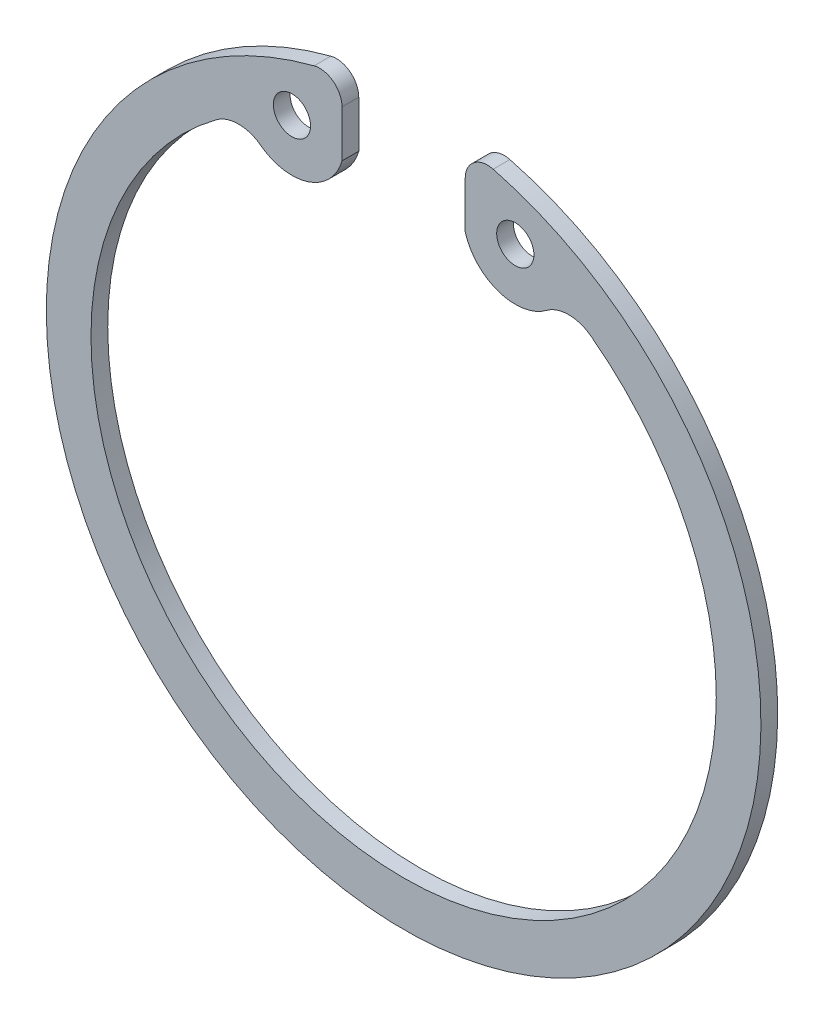
ISO-10303-21;
HEADER;
FILE_DESCRIPTION(('STEP AP214'),'2;1');
FILE_NAME('part.step','',(''),(''),'','','');
FILE_SCHEMA(('AUTOMOTIVE_DESIGN { 1 0 10303 214 1 1 1 1 }'));
ENDSEC;
DATA;
#1=APPLICATION_CONTEXT('core data for automotive mechanical design processes');
#2=APPLICATION_PROTOCOL_DEFINITION('international standard','automotive_design',2000,#1);
#3=PRODUCT_CONTEXT('',#1,'mechanical');
#4=PRODUCT('Part','Part','',(#3));
#5=PRODUCT_RELATED_PRODUCT_CATEGORY('part','',(#4));
#6=PRODUCT_DEFINITION_FORMATION('','',#4);
#7=PRODUCT_DEFINITION_CONTEXT('part definition',#1,'design');
#8=PRODUCT_DEFINITION('design','',#6,#7);
#9=PRODUCT_DEFINITION_SHAPE('','',#8);
#10=(LENGTH_UNIT() NAMED_UNIT(*) SI_UNIT(.MILLI.,.METRE.));
#11=(NAMED_UNIT(*) PLANE_ANGLE_UNIT() SI_UNIT($,.RADIAN.));
#12=(NAMED_UNIT(*) SI_UNIT($,.STERADIAN.) SOLID_ANGLE_UNIT());
#13=UNCERTAINTY_MEASURE_WITH_UNIT(LENGTH_MEASURE(1.E-05),#10,'distance_accuracy_value','');
#14=(GEOMETRIC_REPRESENTATION_CONTEXT(3) GLOBAL_UNCERTAINTY_ASSIGNED_CONTEXT((#13)) GLOBAL_UNIT_ASSIGNED_CONTEXT((#10,
#11,#12)) REPRESENTATION_CONTEXT('',''));
#15=CARTESIAN_POINT('',(0.,0.,0.));
#16=DIRECTION('',(0.,0.,1.));
#17=DIRECTION('',(1.,0.,0.));
#18=AXIS2_PLACEMENT_3D('',#15,#16,#17);
#19=CARTESIAN_POINT('',(-2.86411934203322,11.0653386931712,0.));
#20=DIRECTION('',(0.,0.,1.));
#21=DIRECTION('',(1.,0.,0.));
#22=AXIS2_PLACEMENT_3D('',#19,#20,#21);
#23=PLANE('',#22);
#24=DIRECTION('',(0.,1.,0.));
#25=VECTOR('',#24,1.);
#26=CARTESIAN_POINT('',(-2.10211934203322,11.0653386931712,0.));
#27=LINE('',#26,#25);
#28=CARTESIAN_POINT('',(-2.10211934203322,9.47004672873562,0.));
#29=VERTEX_POINT('',#28);
#30=CARTESIAN_POINT('',(-2.10211934203322,11.0653386931712,0.));
#31=VERTEX_POINT('',#30);
#32=EDGE_CURVE('E91',#29,#31,#27,.T.);
#33=ORIENTED_EDGE('',*,*,#32,.F.);
#34=CARTESIAN_POINT('',(-3.81,9.96444298493399,0.));
#35=DIRECTION('',(0.,0.,1.));
#36=DIRECTION('',(1.,0.,0.));
#37=AXIS2_PLACEMENT_3D('',#34,#35,#36);
#38=CIRCLE('',#37,1.778);
#39=CARTESIAN_POINT('',(-4.87382343732679,8.53981542160587,0.));
#40=VERTEX_POINT('',#39);
#41=EDGE_CURVE('E122',#40,#29,#38,.T.);
#42=ORIENTED_EDGE('',*,*,#41,.F.);
#43=CARTESIAN_POINT('',(-5.63369732113164,7.52222430494292,0.));
#44=DIRECTION('',(0.,0.,1.));
#45=DIRECTION('',(1.,0.,0.));
#46=AXIS2_PLACEMENT_3D('',#43,#44,#45);
#47=CIRCLE('',#46,1.27);
#48=CARTESIAN_POINT('',(-6.39500776993322,8.53874110290818,0.));
#49=VERTEX_POINT('',#48);
#50=EDGE_CURVE('E125',#40,#49,#47,.T.);
#51=ORIENTED_EDGE('',*,*,#50,.T.);
#52=CARTESIAN_POINT('',(0.,0.,0.));
#53=DIRECTION('',(0.,0.,1.));
#54=DIRECTION('',(1.,0.,0.));
#55=AXIS2_PLACEMENT_3D('',#52,#53,#54);
#56=CIRCLE('',#55,10.668);
#57=CARTESIAN_POINT('',(6.39500780535568,8.53874107637886,0.));
#58=VERTEX_POINT('',#57);
#59=EDGE_CURVE('E126',#49,#58,#56,.T.);
#60=ORIENTED_EDGE('',*,*,#59,.T.);
#61=CARTESIAN_POINT('',(5.63369732113164,7.52222430494292,0.));
#62=DIRECTION('',(0.,0.,1.));
#63=DIRECTION('',(1.,0.,0.));
#64=AXIS2_PLACEMENT_3D('',#61,#62,#63);
#65=CIRCLE('',#64,1.26999999999999);
#66=CARTESIAN_POINT('',(4.8738234373268,8.53981542160585,0.));
#67=VERTEX_POINT('',#66);
#68=EDGE_CURVE('E129',#58,#67,#65,.T.);
#69=ORIENTED_EDGE('',*,*,#68,.T.);
#70=CARTESIAN_POINT('',(3.81,9.96444298493396,0.));
#71=DIRECTION('',(0.,0.,1.));
#72=DIRECTION('',(1.,0.,0.));
#73=AXIS2_PLACEMENT_3D('',#70,#71,#72);
#74=CIRCLE('',#73,1.778);
#75=CARTESIAN_POINT('',(2.10211934203322,9.47004672873561,0.));
#76=VERTEX_POINT('',#75);
#77=EDGE_CURVE('E135',#76,#67,#74,.T.);
#78=ORIENTED_EDGE('',*,*,#77,.F.);
#79=DIRECTION('',(0.,1.,0.));
#80=VECTOR('',#79,1.);
#81=CARTESIAN_POINT('',(2.10211934203322,11.0653386931712,0.));
#82=LINE('',#81,#80);
#83=CARTESIAN_POINT('',(2.10211934203322,11.0653386931712,0.));
#84=VERTEX_POINT('',#83);
#85=EDGE_CURVE('E138',#76,#84,#82,.T.);
#86=ORIENTED_EDGE('',*,*,#85,.T.);
#87=CARTESIAN_POINT('',(2.86411934203322,11.0653386931712,0.));
#88=DIRECTION('',(0.,0.,1.));
#89=DIRECTION('',(1.,0.,0.));
#90=AXIS2_PLACEMENT_3D('',#87,#88,#89);
#91=CIRCLE('',#90,0.762);
#92=CARTESIAN_POINT('',(3.0550606315021,11.8030279393826,0.));
#93=VERTEX_POINT('',#92);
#94=EDGE_CURVE('E142',#93,#84,#91,.T.);
#95=ORIENTED_EDGE('',*,*,#94,.F.);
#96=CARTESIAN_POINT('',(0.,0.,0.));
#97=DIRECTION('',(0.,0.,1.));
#98=DIRECTION('',(1.,0.,0.));
#99=AXIS2_PLACEMENT_3D('',#96,#97,#98);
#100=CIRCLE('',#99,12.192);
#101=CARTESIAN_POINT('',(-3.0550606315021,11.8030279393826,0.));
#102=VERTEX_POINT('',#101);
#103=EDGE_CURVE('E103',#102,#93,#100,.T.);
#104=ORIENTED_EDGE('',*,*,#103,.F.);
#105=CARTESIAN_POINT('',(-2.86411934203322,11.0653386931712,0.));
#106=DIRECTION('',(0.,0.,1.));
#107=DIRECTION('',(1.,0.,0.));
#108=AXIS2_PLACEMENT_3D('',#105,#106,#107);
#109=CIRCLE('',#108,0.762);
#110=EDGE_CURVE('E100',#31,#102,#109,.T.);
#111=ORIENTED_EDGE('',*,*,#110,.F.);
#112=EDGE_LOOP('',(#33,#42,#51,#60,#69,#78,#86,#95,#104,#111));
#113=FACE_BOUND('',#112,.T.);
#114=CARTESIAN_POINT('',(3.81,9.96444298493396,0.));
#115=DIRECTION('',(0.,0.,1.));
#116=DIRECTION('',(1.,0.,0.));
#117=AXIS2_PLACEMENT_3D('',#114,#115,#116);
#118=CIRCLE('',#117,0.635);
#119=CARTESIAN_POINT('',(4.445,9.96444298493396,0.));
#120=VERTEX_POINT('',#119);
#121=EDGE_CURVE('E106',#120,#120,#118,.T.);
#122=ORIENTED_EDGE('',*,*,#121,.T.);
#123=EDGE_LOOP('',(#122));
#124=FACE_BOUND('',#123,.T.);
#125=CARTESIAN_POINT('',(-3.81,9.96444298493399,0.));
#126=DIRECTION('',(0.,0.,1.));
#127=DIRECTION('',(1.,0.,0.));
#128=AXIS2_PLACEMENT_3D('',#125,#126,#127);
#129=CIRCLE('',#128,0.635);
#130=CARTESIAN_POINT('',(-3.175,9.96444298493399,0.));
#131=VERTEX_POINT('',#130);
#132=EDGE_CURVE('E20',#131,#131,#129,.T.);
#133=ORIENTED_EDGE('',*,*,#132,.T.);
#134=EDGE_LOOP('',(#133));
#135=FACE_BOUND('',#134,.T.);
#136=ADVANCED_FACE('F17',(#113,#124,#135),#23,.F.);
#137=CARTESIAN_POINT('',(-3.81,9.96444298493399,0.5715));
#138=DIRECTION('',(0.,0.,1.));
#139=DIRECTION('',(1.,0.,0.));
#140=AXIS2_PLACEMENT_3D('',#137,#138,#139);
#141=CYLINDRICAL_SURFACE('',#140,0.635);
#142=ORIENTED_EDGE('',*,*,#132,.F.);
#143=EDGE_LOOP('',(#142));
#144=FACE_BOUND('',#143,.T.);
#145=CARTESIAN_POINT('',(-3.81,9.96444298493399,0.5715));
#146=DIRECTION('',(0.,0.,1.));
#147=DIRECTION('',(1.,0.,0.));
#148=AXIS2_PLACEMENT_3D('',#145,#146,#147);
#149=CIRCLE('',#148,0.635);
#150=CARTESIAN_POINT('',(-3.175,9.96444298493399,0.5715));
#151=VERTEX_POINT('',#150);
#152=EDGE_CURVE('E111',#151,#151,#149,.F.);
#153=ORIENTED_EDGE('',*,*,#152,.F.);
#154=EDGE_LOOP('',(#153));
#155=FACE_BOUND('',#154,.T.);
#156=ADVANCED_FACE('F186',(#144,#155),#141,.F.);
#157=CARTESIAN_POINT('',(3.81,9.96444298493396,0.5715));
#158=DIRECTION('',(0.,0.,1.));
#159=DIRECTION('',(1.,0.,0.));
#160=AXIS2_PLACEMENT_3D('',#157,#158,#159);
#161=CYLINDRICAL_SURFACE('',#160,0.635);
#162=ORIENTED_EDGE('',*,*,#121,.F.);
#163=EDGE_LOOP('',(#162));
#164=FACE_BOUND('',#163,.T.);
#165=CARTESIAN_POINT('',(3.81,9.96444298493396,0.5715));
#166=DIRECTION('',(0.,0.,1.));
#167=DIRECTION('',(1.,0.,0.));
#168=AXIS2_PLACEMENT_3D('',#165,#166,#167);
#169=CIRCLE('',#168,0.635);
#170=CARTESIAN_POINT('',(4.445,9.96444298493396,0.5715));
#171=VERTEX_POINT('',#170);
#172=EDGE_CURVE('E114',#171,#171,#169,.F.);
#173=ORIENTED_EDGE('',*,*,#172,.F.);
#174=EDGE_LOOP('',(#173));
#175=FACE_BOUND('',#174,.T.);
#176=ADVANCED_FACE('F189',(#164,#175),#161,.F.);
#177=CARTESIAN_POINT('',(-2.86411934203322,11.0653386931712,0.5715));
#178=DIRECTION('',(0.,0.,1.));
#179=DIRECTION('',(1.,0.,0.));
#180=AXIS2_PLACEMENT_3D('',#177,#178,#179);
#181=CYLINDRICAL_SURFACE('',#180,0.762);
#182=CARTESIAN_POINT('',(-2.86411934203322,11.0653386931712,0.5715));
#183=DIRECTION('',(0.,0.,1.));
#184=DIRECTION('',(1.,0.,0.));
#185=AXIS2_PLACEMENT_3D('',#182,#183,#184);
#186=CIRCLE('',#185,0.762);
#187=CARTESIAN_POINT('',(-2.10211934203322,11.0653386931712,0.5715));
#188=VERTEX_POINT('',#187);
#189=CARTESIAN_POINT('',(-3.0550606315021,11.8030279393826,0.5715));
#190=VERTEX_POINT('',#189);
#191=EDGE_CURVE('E110',#188,#190,#186,.T.);
#192=ORIENTED_EDGE('',*,*,#191,.F.);
#193=DIRECTION('',(0.,0.,1.));
#194=VECTOR('',#193,1.);
#195=CARTESIAN_POINT('',(-2.10211934203322,11.0653386931712,0.5715));
#196=LINE('',#195,#194);
#197=EDGE_CURVE('E95',#188,#31,#196,.F.);
#198=ORIENTED_EDGE('',*,*,#197,.T.);
#199=ORIENTED_EDGE('',*,*,#110,.T.);
#200=DIRECTION('',(0.,0.,1.));
#201=VECTOR('',#200,1.);
#202=CARTESIAN_POINT('',(-3.0550606315021,11.8030279393826,0.5715));
#203=LINE('',#202,#201);
#204=EDGE_CURVE('E143',#190,#102,#203,.F.);
#205=ORIENTED_EDGE('',*,*,#204,.F.);
#206=EDGE_LOOP('',(#192,#198,#199,#205));
#207=FACE_BOUND('',#206,.T.);
#208=ADVANCED_FACE('F108',(#207),#181,.T.);
#209=CARTESIAN_POINT('',(0.,0.,0.5715));
#210=DIRECTION('',(0.,0.,1.));
#211=DIRECTION('',(1.,0.,0.));
#212=AXIS2_PLACEMENT_3D('',#209,#210,#211);
#213=CYLINDRICAL_SURFACE('',#212,12.192);
#214=CARTESIAN_POINT('',(0.,0.,0.5715));
#215=DIRECTION('',(0.,0.,1.));
#216=DIRECTION('',(1.,0.,0.));
#217=AXIS2_PLACEMENT_3D('',#214,#215,#216);
#218=CIRCLE('',#217,12.192);
#219=CARTESIAN_POINT('',(3.0550606315021,11.8030279393826,0.5715));
#220=VERTEX_POINT('',#219);
#221=EDGE_CURVE('E165',#190,#220,#218,.T.);
#222=ORIENTED_EDGE('',*,*,#221,.F.);
#223=ORIENTED_EDGE('',*,*,#204,.T.);
#224=ORIENTED_EDGE('',*,*,#103,.T.);
#225=DIRECTION('',(0.,0.,1.));
#226=VECTOR('',#225,1.);
#227=CARTESIAN_POINT('',(3.05506063150211,11.8030279393826,0.5715));
#228=LINE('',#227,#226);
#229=EDGE_CURVE('E139',#220,#93,#228,.F.);
#230=ORIENTED_EDGE('',*,*,#229,.F.);
#231=EDGE_LOOP('',(#222,#223,#224,#230));
#232=FACE_BOUND('',#231,.T.);
#233=ADVANCED_FACE('F229',(#232),#213,.T.);
#234=CARTESIAN_POINT('',(2.86411934203322,11.0653386931712,0.5715));
#235=DIRECTION('',(0.,0.,1.));
#236=DIRECTION('',(1.,0.,0.));
#237=AXIS2_PLACEMENT_3D('',#234,#235,#236);
#238=CYLINDRICAL_SURFACE('',#237,0.762);
#239=CARTESIAN_POINT('',(2.86411934203322,11.0653386931712,0.5715));
#240=DIRECTION('',(0.,0.,1.));
#241=DIRECTION('',(1.,0.,0.));
#242=AXIS2_PLACEMENT_3D('',#239,#240,#241);
#243=CIRCLE('',#242,0.762);
#244=CARTESIAN_POINT('',(2.10211934203322,11.0653386931712,0.5715));
#245=VERTEX_POINT('',#244);
#246=EDGE_CURVE('E162',#220,#245,#243,.T.);
#247=ORIENTED_EDGE('',*,*,#246,.F.);
#248=ORIENTED_EDGE('',*,*,#229,.T.);
#249=ORIENTED_EDGE('',*,*,#94,.T.);
#250=DIRECTION('',(0.,0.,-1.));
#251=VECTOR('',#250,1.);
#252=CARTESIAN_POINT('',(2.10211934203322,11.0653386931712,0.5715));
#253=LINE('',#252,#251);
#254=EDGE_CURVE('E136',#84,#245,#253,.F.);
#255=ORIENTED_EDGE('',*,*,#254,.T.);
#256=EDGE_LOOP('',(#247,#248,#249,#255));
#257=FACE_BOUND('',#256,.T.);
#258=ADVANCED_FACE('F225',(#257),#238,.T.);
#259=CARTESIAN_POINT('',(2.10211934203322,11.0653386931712,0.5715));
#260=DIRECTION('',(1.,0.,0.));
#261=DIRECTION('',(0.,0.,-1.));
#262=AXIS2_PLACEMENT_3D('',#259,#260,#261);
#263=PLANE('',#262);
#264=DIRECTION('',(0.,0.,1.));
#265=VECTOR('',#264,1.);
#266=CARTESIAN_POINT('',(2.10211934203321,9.47004672873562,0.5715));
#267=LINE('',#266,#265);
#268=CARTESIAN_POINT('',(2.10211934203322,9.47004672873561,0.5715));
#269=VERTEX_POINT('',#268);
#270=EDGE_CURVE('E132',#269,#76,#267,.F.);
#271=ORIENTED_EDGE('',*,*,#270,.F.);
#272=DIRECTION('',(0.,1.,0.));
#273=VECTOR('',#272,1.);
#274=CARTESIAN_POINT('',(2.10211934203322,11.0653386931712,0.5715));
#275=LINE('',#274,#273);
#276=EDGE_CURVE('E161',#245,#269,#275,.F.);
#277=ORIENTED_EDGE('',*,*,#276,.F.);
#278=ORIENTED_EDGE('',*,*,#254,.F.);
#279=ORIENTED_EDGE('',*,*,#85,.F.);
#280=EDGE_LOOP('',(#271,#277,#278,#279));
#281=FACE_BOUND('',#280,.T.);
#282=ADVANCED_FACE('F221',(#281),#263,.F.);
#283=CARTESIAN_POINT('',(3.81,9.96444298493396,0.5715));
#284=DIRECTION('',(0.,0.,1.));
#285=DIRECTION('',(1.,0.,0.));
#286=AXIS2_PLACEMENT_3D('',#283,#284,#285);
#287=CYLINDRICAL_SURFACE('',#286,1.778);
#288=CARTESIAN_POINT('',(3.81,9.96444298493396,0.5715));
#289=DIRECTION('',(0.,0.,1.));
#290=DIRECTION('',(1.,0.,0.));
#291=AXIS2_PLACEMENT_3D('',#288,#289,#290);
#292=CIRCLE('',#291,1.778);
#293=CARTESIAN_POINT('',(4.8738234373268,8.53981542160586,0.5715));
#294=VERTEX_POINT('',#293);
#295=EDGE_CURVE('E158',#269,#294,#292,.T.);
#296=ORIENTED_EDGE('',*,*,#295,.F.);
#297=ORIENTED_EDGE('',*,*,#270,.T.);
#298=ORIENTED_EDGE('',*,*,#77,.T.);
#299=DIRECTION('',(0.,0.,1.));
#300=VECTOR('',#299,1.);
#301=CARTESIAN_POINT('',(4.8738234373268,8.53981542160586,0.5715));
#302=LINE('',#301,#300);
#303=EDGE_CURVE('E130',#67,#294,#302,.T.);
#304=ORIENTED_EDGE('',*,*,#303,.T.);
#305=EDGE_LOOP('',(#296,#297,#298,#304));
#306=FACE_BOUND('',#305,.T.);
#307=ADVANCED_FACE('F217',(#306),#287,.T.);
#308=CARTESIAN_POINT('',(5.63369732113164,7.52222430494292,0.5715));
#309=DIRECTION('',(0.,0.,1.));
#310=DIRECTION('',(1.,0.,0.));
#311=AXIS2_PLACEMENT_3D('',#308,#309,#310);
#312=CYLINDRICAL_SURFACE('',#311,1.26999999999999);
#313=DIRECTION('',(0.,0.,1.));
#314=VECTOR('',#313,1.);
#315=CARTESIAN_POINT('',(6.39500784077815,8.53874104984956,0.5715));
#316=LINE('',#315,#314);
#317=CARTESIAN_POINT('',(6.39500780535568,8.53874107637887,0.5715));
#318=VERTEX_POINT('',#317);
#319=EDGE_CURVE('E127',#58,#318,#316,.T.);
#320=ORIENTED_EDGE('',*,*,#319,.T.);
#321=CARTESIAN_POINT('',(5.63369732113164,7.52222430494292,0.5715));
#322=DIRECTION('',(0.,0.,1.));
#323=DIRECTION('',(1.,0.,0.));
#324=AXIS2_PLACEMENT_3D('',#321,#322,#323);
#325=CIRCLE('',#324,1.26999999999999);
#326=EDGE_CURVE('E155',#294,#318,#325,.F.);
#327=ORIENTED_EDGE('',*,*,#326,.F.);
#328=ORIENTED_EDGE('',*,*,#303,.F.);
#329=ORIENTED_EDGE('',*,*,#68,.F.);
#330=EDGE_LOOP('',(#320,#327,#328,#329));
#331=FACE_BOUND('',#330,.T.);
#332=ADVANCED_FACE('F213',(#331),#312,.F.);
#333=CARTESIAN_POINT('',(0.,0.,0.5715));
#334=DIRECTION('',(0.,0.,1.));
#335=DIRECTION('',(1.,0.,0.));
#336=AXIS2_PLACEMENT_3D('',#333,#334,#335);
#337=CYLINDRICAL_SURFACE('',#336,10.668);
#338=DIRECTION('',(0.,0.,1.));
#339=VECTOR('',#338,1.);
#340=CARTESIAN_POINT('',(-6.39500776993322,8.53874110290817,0.5715));
#341=LINE('',#340,#339);
#342=CARTESIAN_POINT('',(-6.39500776993322,8.53874110290817,0.5715));
#343=VERTEX_POINT('',#342);
#344=EDGE_CURVE('E123',#49,#343,#341,.T.);
#345=ORIENTED_EDGE('',*,*,#344,.T.);
#346=CARTESIAN_POINT('',(0.,0.,0.5715));
#347=DIRECTION('',(0.,0.,1.));
#348=DIRECTION('',(1.,0.,0.));
#349=AXIS2_PLACEMENT_3D('',#346,#347,#348);
#350=CIRCLE('',#349,10.668);
#351=EDGE_CURVE('E152',#318,#343,#350,.F.);
#352=ORIENTED_EDGE('',*,*,#351,.F.);
#353=ORIENTED_EDGE('',*,*,#319,.F.);
#354=ORIENTED_EDGE('',*,*,#59,.F.);
#355=EDGE_LOOP('',(#345,#352,#353,#354));
#356=FACE_BOUND('',#355,.T.);
#357=ADVANCED_FACE('F209',(#356),#337,.F.);
#358=CARTESIAN_POINT('',(-5.63369732113164,7.52222430494292,0.5715));
#359=DIRECTION('',(0.,0.,1.));
#360=DIRECTION('',(1.,0.,0.));
#361=AXIS2_PLACEMENT_3D('',#358,#359,#360);
#362=CYLINDRICAL_SURFACE('',#361,1.27);
#363=DIRECTION('',(0.,0.,1.));
#364=VECTOR('',#363,1.);
#365=CARTESIAN_POINT('',(-4.87382343732679,8.53981542160587,0.5715));
#366=LINE('',#365,#364);
#367=CARTESIAN_POINT('',(-4.87382343732679,8.53981542160587,0.5715));
#368=VERTEX_POINT('',#367);
#369=EDGE_CURVE('E116',#368,#40,#366,.F.);
#370=ORIENTED_EDGE('',*,*,#369,.F.);
#371=CARTESIAN_POINT('',(-5.63369732113164,7.52222430494292,0.5715));
#372=DIRECTION('',(0.,0.,1.));
#373=DIRECTION('',(1.,0.,0.));
#374=AXIS2_PLACEMENT_3D('',#371,#372,#373);
#375=CIRCLE('',#374,1.27);
#376=EDGE_CURVE('E149',#343,#368,#375,.F.);
#377=ORIENTED_EDGE('',*,*,#376,.F.);
#378=ORIENTED_EDGE('',*,*,#344,.F.);
#379=ORIENTED_EDGE('',*,*,#50,.F.);
#380=EDGE_LOOP('',(#370,#377,#378,#379));
#381=FACE_BOUND('',#380,.T.);
#382=ADVANCED_FACE('F206',(#381),#362,.F.);
#383=CARTESIAN_POINT('',(-3.81,9.96444298493399,0.5715));
#384=DIRECTION('',(0.,0.,1.));
#385=DIRECTION('',(1.,0.,0.));
#386=AXIS2_PLACEMENT_3D('',#383,#384,#385);
#387=CYLINDRICAL_SURFACE('',#386,1.778);
#388=CARTESIAN_POINT('',(-3.81,9.96444298493399,0.5715));
#389=DIRECTION('',(0.,0.,1.));
#390=DIRECTION('',(1.,0.,0.));
#391=AXIS2_PLACEMENT_3D('',#388,#389,#390);
#392=CIRCLE('',#391,1.778);
#393=CARTESIAN_POINT('',(-2.10211934203322,9.47004672873562,0.5715));
#394=VERTEX_POINT('',#393);
#395=EDGE_CURVE('E26',#368,#394,#392,.T.);
#396=ORIENTED_EDGE('',*,*,#395,.F.);
#397=ORIENTED_EDGE('',*,*,#369,.T.);
#398=ORIENTED_EDGE('',*,*,#41,.T.);
#399=DIRECTION('',(0.,0.,1.));
#400=VECTOR('',#399,1.);
#401=CARTESIAN_POINT('',(-2.10211934203322,9.47004672873562,0.5715));
#402=LINE('',#401,#400);
#403=EDGE_CURVE('E35',#29,#394,#402,.T.);
#404=ORIENTED_EDGE('',*,*,#403,.T.);
#405=EDGE_LOOP('',(#396,#397,#398,#404));
#406=FACE_BOUND('',#405,.T.);
#407=ADVANCED_FACE('F200',(#406),#387,.T.);
#408=CARTESIAN_POINT('',(-2.10211934203322,9.47004672873562,0.5715));
#409=DIRECTION('',(-1.,0.,0.));
#410=DIRECTION('',(0.,0.,1.));
#411=AXIS2_PLACEMENT_3D('',#408,#409,#410);
#412=PLANE('',#411);
#413=ORIENTED_EDGE('',*,*,#197,.F.);
#414=DIRECTION('',(0.,1.,0.));
#415=VECTOR('',#414,1.);
#416=CARTESIAN_POINT('',(-2.10211934203322,11.0653386931712,0.5715));
#417=LINE('',#416,#415);
#418=EDGE_CURVE('E11',#394,#188,#417,.T.);
#419=ORIENTED_EDGE('',*,*,#418,.F.);
#420=ORIENTED_EDGE('',*,*,#403,.F.);
#421=ORIENTED_EDGE('',*,*,#32,.T.);
#422=EDGE_LOOP('',(#413,#419,#420,#421));
#423=FACE_BOUND('',#422,.T.);
#424=ADVANCED_FACE('F93',(#423),#412,.F.);
#425=CARTESIAN_POINT('',(-2.86411934203322,11.0653386931712,0.5715));
#426=DIRECTION('',(0.,0.,1.));
#427=DIRECTION('',(1.,0.,0.));
#428=AXIS2_PLACEMENT_3D('',#425,#426,#427);
#429=PLANE('',#428);
#430=ORIENTED_EDGE('',*,*,#395,.T.);
#431=ORIENTED_EDGE('',*,*,#418,.T.);
#432=ORIENTED_EDGE('',*,*,#191,.T.);
#433=ORIENTED_EDGE('',*,*,#221,.T.);
#434=ORIENTED_EDGE('',*,*,#246,.T.);
#435=ORIENTED_EDGE('',*,*,#276,.T.);
#436=ORIENTED_EDGE('',*,*,#295,.T.);
#437=ORIENTED_EDGE('',*,*,#326,.T.);
#438=ORIENTED_EDGE('',*,*,#351,.T.);
#439=ORIENTED_EDGE('',*,*,#376,.T.);
#440=EDGE_LOOP('',(#430,#431,#432,#433,#434,#435,#436,#437,#438,#439));
#441=FACE_BOUND('',#440,.T.);
#442=ORIENTED_EDGE('',*,*,#172,.T.);
#443=EDGE_LOOP('',(#442));
#444=FACE_BOUND('',#443,.T.);
#445=ORIENTED_EDGE('',*,*,#152,.T.);
#446=EDGE_LOOP('',(#445));
#447=FACE_BOUND('',#446,.T.);
#448=ADVANCED_FACE('F192',(#441,#444,#447),#429,.T.);
#449=CLOSED_SHELL('',(#136,#156,#176,#208,#233,#258,#282,#307,#332,#357,#382,#407,#424,#448));
#450=MANIFOLD_SOLID_BREP('B1',#449);
#451=ADVANCED_BREP_SHAPE_REPRESENTATION('',(#18,#450),#14);
#452=SHAPE_DEFINITION_REPRESENTATION(#9,#451);
ENDSEC;
END-ISO-10303-21;
